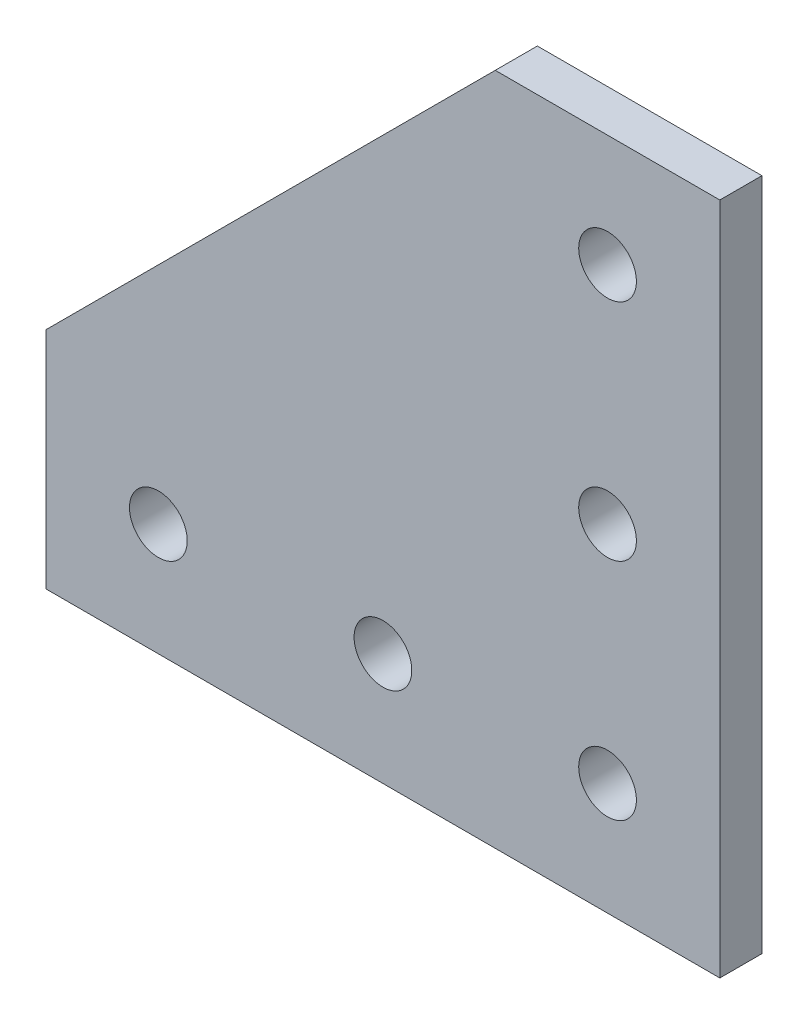
ISO-10303-21;
HEADER;
FILE_DESCRIPTION(('STEP AP214'),'2;1');
FILE_NAME('part.step','',(''),(''),'','','');
FILE_SCHEMA(('AUTOMOTIVE_DESIGN { 1 0 10303 214 1 1 1 1 }'));
ENDSEC;
DATA;
#1=APPLICATION_CONTEXT('core data for automotive mechanical design processes');
#2=APPLICATION_PROTOCOL_DEFINITION('international standard','automotive_design',2000,#1);
#3=PRODUCT_CONTEXT('',#1,'mechanical');
#4=PRODUCT('Part','Part','',(#3));
#5=PRODUCT_RELATED_PRODUCT_CATEGORY('part','',(#4));
#6=PRODUCT_DEFINITION_FORMATION('','',#4);
#7=PRODUCT_DEFINITION_CONTEXT('part definition',#1,'design');
#8=PRODUCT_DEFINITION('design','',#6,#7);
#9=PRODUCT_DEFINITION_SHAPE('','',#8);
#10=(LENGTH_UNIT() NAMED_UNIT(*) SI_UNIT(.MILLI.,.METRE.));
#11=(NAMED_UNIT(*) PLANE_ANGLE_UNIT() SI_UNIT($,.RADIAN.));
#12=(NAMED_UNIT(*) SI_UNIT($,.STERADIAN.) SOLID_ANGLE_UNIT());
#13=UNCERTAINTY_MEASURE_WITH_UNIT(LENGTH_MEASURE(1.E-05),#10,'distance_accuracy_value','');
#14=(GEOMETRIC_REPRESENTATION_CONTEXT(3) GLOBAL_UNCERTAINTY_ASSIGNED_CONTEXT((#13)) GLOBAL_UNIT_ASSIGNED_CONTEXT((#10,
#11,#12)) REPRESENTATION_CONTEXT('',''));
#15=CARTESIAN_POINT('',(0.,0.,0.));
#16=DIRECTION('',(0.,0.,1.));
#17=DIRECTION('',(1.,0.,0.));
#18=AXIS2_PLACEMENT_3D('',#15,#16,#17);
#19=CARTESIAN_POINT('',(-25.4,-25.4,-4.7625));
#20=DIRECTION('',(-0.707106781186548,0.707106781186547,0.));
#21=DIRECTION('',(-0.707106781186547,-0.707106781186548,0.));
#22=AXIS2_PLACEMENT_3D('',#19,#20,#21);
#23=PLANE('',#22);
#24=DIRECTION('',(-0.707106781186547,-0.707106781186548,0.));
#25=VECTOR('',#24,1.);
#26=CARTESIAN_POINT('',(-25.4,-25.4,0.));
#27=LINE('',#26,#25);
#28=CARTESIAN_POINT('',(25.4,25.4,0.));
#29=VERTEX_POINT('',#28);
#30=CARTESIAN_POINT('',(-25.4,-25.4,0.));
#31=VERTEX_POINT('',#30);
#32=EDGE_CURVE('E109',#29,#31,#27,.T.);
#33=ORIENTED_EDGE('',*,*,#32,.F.);
#34=DIRECTION('',(0.,0.,1.));
#35=VECTOR('',#34,1.);
#36=CARTESIAN_POINT('',(25.4,25.4,-4.7625));
#37=LINE('',#36,#35);
#38=CARTESIAN_POINT('',(25.4,25.4,-4.7625));
#39=VERTEX_POINT('',#38);
#40=EDGE_CURVE('E11',#39,#29,#37,.T.);
#41=ORIENTED_EDGE('',*,*,#40,.F.);
#42=DIRECTION('',(-0.707106781186547,-0.707106781186548,0.));
#43=VECTOR('',#42,1.);
#44=CARTESIAN_POINT('',(-25.4,-25.4,-4.7625));
#45=LINE('',#44,#43);
#46=CARTESIAN_POINT('',(-25.4,-25.4,-4.7625));
#47=VERTEX_POINT('',#46);
#48=EDGE_CURVE('E104',#39,#47,#45,.T.);
#49=ORIENTED_EDGE('',*,*,#48,.T.);
#50=DIRECTION('',(0.,0.,1.));
#51=VECTOR('',#50,1.);
#52=CARTESIAN_POINT('',(-25.4,-25.4,-4.7625));
#53=LINE('',#52,#51);
#54=EDGE_CURVE('E35',#47,#31,#53,.T.);
#55=ORIENTED_EDGE('',*,*,#54,.T.);
#56=EDGE_LOOP('',(#33,#41,#49,#55));
#57=FACE_BOUND('',#56,.T.);
#58=ADVANCED_FACE('F32',(#57),#23,.T.);
#59=CARTESIAN_POINT('',(25.4,25.4,-4.7625));
#60=DIRECTION('',(0.,1.,0.));
#61=DIRECTION('',(0.,0.,1.));
#62=AXIS2_PLACEMENT_3D('',#59,#60,#61);
#63=PLANE('',#62);
#64=DIRECTION('',(-1.,0.,0.));
#65=VECTOR('',#64,1.);
#66=CARTESIAN_POINT('',(25.4,25.4,0.));
#67=LINE('',#66,#65);
#68=CARTESIAN_POINT('',(50.8,25.4,0.));
#69=VERTEX_POINT('',#68);
#70=EDGE_CURVE('E119',#69,#29,#67,.T.);
#71=ORIENTED_EDGE('',*,*,#70,.F.);
#72=DIRECTION('',(0.,0.,1.));
#73=VECTOR('',#72,1.);
#74=CARTESIAN_POINT('',(50.8,25.4,-4.7625));
#75=LINE('',#74,#73);
#76=CARTESIAN_POINT('',(50.8,25.4,-4.7625));
#77=VERTEX_POINT('',#76);
#78=EDGE_CURVE('E41',#77,#69,#75,.T.);
#79=ORIENTED_EDGE('',*,*,#78,.F.);
#80=DIRECTION('',(-1.,0.,0.));
#81=VECTOR('',#80,1.);
#82=CARTESIAN_POINT('',(25.4,25.4,-4.7625));
#83=LINE('',#82,#81);
#84=EDGE_CURVE('E99',#77,#39,#83,.T.);
#85=ORIENTED_EDGE('',*,*,#84,.T.);
#86=ORIENTED_EDGE('',*,*,#40,.T.);
#87=EDGE_LOOP('',(#71,#79,#85,#86));
#88=FACE_BOUND('',#87,.T.);
#89=ADVANCED_FACE('F125',(#88),#63,.T.);
#90=CARTESIAN_POINT('',(50.8,25.4,-4.7625));
#91=DIRECTION('',(1.,0.,0.));
#92=DIRECTION('',(0.,1.,0.));
#93=AXIS2_PLACEMENT_3D('',#90,#91,#92);
#94=PLANE('',#93);
#95=DIRECTION('',(0.,1.,0.));
#96=VECTOR('',#95,1.);
#97=CARTESIAN_POINT('',(50.8,25.4,0.));
#98=LINE('',#97,#96);
#99=CARTESIAN_POINT('',(50.8,-50.8,0.));
#100=VERTEX_POINT('',#99);
#101=EDGE_CURVE('E88',#100,#69,#98,.T.);
#102=ORIENTED_EDGE('',*,*,#101,.F.);
#103=DIRECTION('',(0.,0.,1.));
#104=VECTOR('',#103,1.);
#105=CARTESIAN_POINT('',(50.8,-50.8,-4.7625));
#106=LINE('',#105,#104);
#107=CARTESIAN_POINT('',(50.8,-50.8,-4.7625));
#108=VERTEX_POINT('',#107);
#109=EDGE_CURVE('E83',#108,#100,#106,.T.);
#110=ORIENTED_EDGE('',*,*,#109,.F.);
#111=DIRECTION('',(0.,1.,0.));
#112=VECTOR('',#111,1.);
#113=CARTESIAN_POINT('',(50.8,25.4,-4.7625));
#114=LINE('',#113,#112);
#115=EDGE_CURVE('E86',#108,#77,#114,.T.);
#116=ORIENTED_EDGE('',*,*,#115,.T.);
#117=ORIENTED_EDGE('',*,*,#78,.T.);
#118=EDGE_LOOP('',(#102,#110,#116,#117));
#119=FACE_BOUND('',#118,.T.);
#120=ADVANCED_FACE('F85',(#119),#94,.T.);
#121=CARTESIAN_POINT('',(50.8,-50.8,-4.7625));
#122=DIRECTION('',(0.,-1.,0.));
#123=DIRECTION('',(1.,0.,0.));
#124=AXIS2_PLACEMENT_3D('',#121,#122,#123);
#125=PLANE('',#124);
#126=DIRECTION('',(1.,0.,0.));
#127=VECTOR('',#126,1.);
#128=CARTESIAN_POINT('',(50.8,-50.8,0.));
#129=LINE('',#128,#127);
#130=CARTESIAN_POINT('',(-25.4,-50.8,0.));
#131=VERTEX_POINT('',#130);
#132=EDGE_CURVE('E116',#131,#100,#129,.T.);
#133=ORIENTED_EDGE('',*,*,#132,.F.);
#134=DIRECTION('',(0.,0.,1.));
#135=VECTOR('',#134,1.);
#136=CARTESIAN_POINT('',(-25.4,-50.8,-4.7625));
#137=LINE('',#136,#135);
#138=CARTESIAN_POINT('',(-25.4,-50.8,-4.7625));
#139=VERTEX_POINT('',#138);
#140=EDGE_CURVE('E93',#139,#131,#137,.T.);
#141=ORIENTED_EDGE('',*,*,#140,.F.);
#142=DIRECTION('',(1.,0.,0.));
#143=VECTOR('',#142,1.);
#144=CARTESIAN_POINT('',(50.8,-50.8,-4.7625));
#145=LINE('',#144,#143);
#146=EDGE_CURVE('E98',#139,#108,#145,.T.);
#147=ORIENTED_EDGE('',*,*,#146,.T.);
#148=ORIENTED_EDGE('',*,*,#109,.T.);
#149=EDGE_LOOP('',(#133,#141,#147,#148));
#150=FACE_BOUND('',#149,.T.);
#151=ADVANCED_FACE('F101',(#150),#125,.T.);
#152=CARTESIAN_POINT('',(-25.4,-50.8,-4.7625));
#153=DIRECTION('',(-1.,0.,0.));
#154=DIRECTION('',(0.,0.,1.));
#155=AXIS2_PLACEMENT_3D('',#152,#153,#154);
#156=PLANE('',#155);
#157=DIRECTION('',(0.,-1.,0.));
#158=VECTOR('',#157,1.);
#159=CARTESIAN_POINT('',(-25.4,-50.8,0.));
#160=LINE('',#159,#158);
#161=EDGE_CURVE('E112',#31,#131,#160,.T.);
#162=ORIENTED_EDGE('',*,*,#161,.F.);
#163=ORIENTED_EDGE('',*,*,#54,.F.);
#164=DIRECTION('',(0.,-1.,0.));
#165=VECTOR('',#164,1.);
#166=CARTESIAN_POINT('',(-25.4,-50.8,-4.7625));
#167=LINE('',#166,#165);
#168=EDGE_CURVE('E102',#47,#139,#167,.T.);
#169=ORIENTED_EDGE('',*,*,#168,.T.);
#170=ORIENTED_EDGE('',*,*,#140,.T.);
#171=EDGE_LOOP('',(#162,#163,#169,#170));
#172=FACE_BOUND('',#171,.T.);
#173=ADVANCED_FACE('F122',(#172),#156,.T.);
#174=CARTESIAN_POINT('',(25.4,25.4,-4.7625));
#175=DIRECTION('',(0.,0.,-1.));
#176=DIRECTION('',(-1.,0.,0.));
#177=AXIS2_PLACEMENT_3D('',#174,#175,#176);
#178=PLANE('',#177);
#179=CARTESIAN_POINT('',(38.1,12.7,-4.7625));
#180=DIRECTION('',(0.,0.,-1.));
#181=DIRECTION('',(-1.,0.,0.));
#182=AXIS2_PLACEMENT_3D('',#179,#180,#181);
#183=CIRCLE('',#182,3.2639);
#184=CARTESIAN_POINT('',(34.8361,12.7,-4.7625));
#185=VERTEX_POINT('',#184);
#186=EDGE_CURVE('E175',#185,#185,#183,.T.);
#187=ORIENTED_EDGE('',*,*,#186,.F.);
#188=EDGE_LOOP('',(#187));
#189=FACE_BOUND('',#188,.T.);
#190=CARTESIAN_POINT('',(38.1,-12.7,-4.7625));
#191=DIRECTION('',(0.,0.,-1.));
#192=DIRECTION('',(-1.,0.,0.));
#193=AXIS2_PLACEMENT_3D('',#190,#191,#192);
#194=CIRCLE('',#193,3.2639);
#195=CARTESIAN_POINT('',(34.8361,-12.7,-4.7625));
#196=VERTEX_POINT('',#195);
#197=EDGE_CURVE('E177',#196,#196,#194,.T.);
#198=ORIENTED_EDGE('',*,*,#197,.F.);
#199=EDGE_LOOP('',(#198));
#200=FACE_BOUND('',#199,.T.);
#201=CARTESIAN_POINT('',(-12.7,-38.1,-4.7625));
#202=DIRECTION('',(0.,0.,-1.));
#203=DIRECTION('',(-1.,0.,0.));
#204=AXIS2_PLACEMENT_3D('',#201,#202,#203);
#205=CIRCLE('',#204,3.2639);
#206=CARTESIAN_POINT('',(-15.9639,-38.1,-4.7625));
#207=VERTEX_POINT('',#206);
#208=EDGE_CURVE('E183',#207,#207,#205,.T.);
#209=ORIENTED_EDGE('',*,*,#208,.F.);
#210=EDGE_LOOP('',(#209));
#211=FACE_BOUND('',#210,.T.);
#212=CARTESIAN_POINT('',(12.7,-38.1,-4.7625));
#213=DIRECTION('',(0.,0.,-1.));
#214=DIRECTION('',(-1.,0.,0.));
#215=AXIS2_PLACEMENT_3D('',#212,#213,#214);
#216=CIRCLE('',#215,3.2639);
#217=CARTESIAN_POINT('',(9.43609999999995,-38.1,-4.7625));
#218=VERTEX_POINT('',#217);
#219=EDGE_CURVE('E189',#218,#218,#216,.T.);
#220=ORIENTED_EDGE('',*,*,#219,.F.);
#221=EDGE_LOOP('',(#220));
#222=FACE_BOUND('',#221,.T.);
#223=CARTESIAN_POINT('',(38.1,-38.1,-4.7625));
#224=DIRECTION('',(0.,0.,-1.));
#225=DIRECTION('',(-1.,0.,0.));
#226=AXIS2_PLACEMENT_3D('',#223,#224,#225);
#227=CIRCLE('',#226,3.2639);
#228=CARTESIAN_POINT('',(34.8361,-38.1,-4.7625));
#229=VERTEX_POINT('',#228);
#230=EDGE_CURVE('E195',#229,#229,#227,.T.);
#231=ORIENTED_EDGE('',*,*,#230,.F.);
#232=EDGE_LOOP('',(#231));
#233=FACE_BOUND('',#232,.T.);
#234=ORIENTED_EDGE('',*,*,#48,.F.);
#235=ORIENTED_EDGE('',*,*,#84,.F.);
#236=ORIENTED_EDGE('',*,*,#115,.F.);
#237=ORIENTED_EDGE('',*,*,#146,.F.);
#238=ORIENTED_EDGE('',*,*,#168,.F.);
#239=EDGE_LOOP('',(#234,#235,#236,#237,#238));
#240=FACE_BOUND('',#239,.T.);
#241=ADVANCED_FACE('F97',(#189,#200,#211,#222,#233,#240),#178,.T.);
#242=CARTESIAN_POINT('',(25.4,25.4,0.));
#243=DIRECTION('',(0.,0.,-1.));
#244=DIRECTION('',(-1.,0.,0.));
#245=AXIS2_PLACEMENT_3D('',#242,#243,#244);
#246=PLANE('',#245);
#247=CARTESIAN_POINT('',(38.1,12.7,0.));
#248=DIRECTION('',(0.,0.,-1.));
#249=DIRECTION('',(-1.,0.,0.));
#250=AXIS2_PLACEMENT_3D('',#247,#248,#249);
#251=CIRCLE('',#250,3.2639);
#252=CARTESIAN_POINT('',(34.8361,12.7,0.));
#253=VERTEX_POINT('',#252);
#254=EDGE_CURVE('E173',#253,#253,#251,.T.);
#255=ORIENTED_EDGE('',*,*,#254,.T.);
#256=EDGE_LOOP('',(#255));
#257=FACE_BOUND('',#256,.T.);
#258=CARTESIAN_POINT('',(38.1,-12.7,0.));
#259=DIRECTION('',(0.,0.,-1.));
#260=DIRECTION('',(-1.,0.,0.));
#261=AXIS2_PLACEMENT_3D('',#258,#259,#260);
#262=CIRCLE('',#261,3.2639);
#263=CARTESIAN_POINT('',(34.8361,-12.7,0.));
#264=VERTEX_POINT('',#263);
#265=EDGE_CURVE('E180',#264,#264,#262,.T.);
#266=ORIENTED_EDGE('',*,*,#265,.T.);
#267=EDGE_LOOP('',(#266));
#268=FACE_BOUND('',#267,.T.);
#269=CARTESIAN_POINT('',(-12.7,-38.1,0.));
#270=DIRECTION('',(0.,0.,-1.));
#271=DIRECTION('',(-1.,0.,0.));
#272=AXIS2_PLACEMENT_3D('',#269,#270,#271);
#273=CIRCLE('',#272,3.2639);
#274=CARTESIAN_POINT('',(-15.9639,-38.1,0.));
#275=VERTEX_POINT('',#274);
#276=EDGE_CURVE('E186',#275,#275,#273,.T.);
#277=ORIENTED_EDGE('',*,*,#276,.T.);
#278=EDGE_LOOP('',(#277));
#279=FACE_BOUND('',#278,.T.);
#280=CARTESIAN_POINT('',(12.7,-38.1,0.));
#281=DIRECTION('',(0.,0.,-1.));
#282=DIRECTION('',(-1.,0.,0.));
#283=AXIS2_PLACEMENT_3D('',#280,#281,#282);
#284=CIRCLE('',#283,3.2639);
#285=CARTESIAN_POINT('',(9.43609999999995,-38.1,0.));
#286=VERTEX_POINT('',#285);
#287=EDGE_CURVE('E192',#286,#286,#284,.T.);
#288=ORIENTED_EDGE('',*,*,#287,.T.);
#289=EDGE_LOOP('',(#288));
#290=FACE_BOUND('',#289,.T.);
#291=CARTESIAN_POINT('',(38.1,-38.1,0.));
#292=DIRECTION('',(0.,0.,-1.));
#293=DIRECTION('',(-1.,0.,0.));
#294=AXIS2_PLACEMENT_3D('',#291,#292,#293);
#295=CIRCLE('',#294,3.2639);
#296=CARTESIAN_POINT('',(34.8361,-38.1,0.));
#297=VERTEX_POINT('',#296);
#298=EDGE_CURVE('E113',#297,#297,#295,.T.);
#299=ORIENTED_EDGE('',*,*,#298,.T.);
#300=EDGE_LOOP('',(#299));
#301=FACE_BOUND('',#300,.T.);
#302=ORIENTED_EDGE('',*,*,#32,.T.);
#303=ORIENTED_EDGE('',*,*,#161,.T.);
#304=ORIENTED_EDGE('',*,*,#132,.T.);
#305=ORIENTED_EDGE('',*,*,#101,.T.);
#306=ORIENTED_EDGE('',*,*,#70,.T.);
#307=EDGE_LOOP('',(#302,#303,#304,#305,#306));
#308=FACE_BOUND('',#307,.T.);
#309=ADVANCED_FACE('F124',(#257,#268,#279,#290,#301,#308),#246,.F.);
#310=CARTESIAN_POINT('',(38.1,-38.1,0.));
#311=DIRECTION('',(0.,0.,-1.));
#312=DIRECTION('',(-1.,0.,0.));
#313=AXIS2_PLACEMENT_3D('',#310,#311,#312);
#314=CYLINDRICAL_SURFACE('',#313,3.2639);
#315=ORIENTED_EDGE('',*,*,#298,.F.);
#316=EDGE_LOOP('',(#315));
#317=FACE_BOUND('',#316,.T.);
#318=ORIENTED_EDGE('',*,*,#230,.T.);
#319=EDGE_LOOP('',(#318));
#320=FACE_BOUND('',#319,.T.);
#321=ADVANCED_FACE('F145',(#317,#320),#314,.F.);
#322=CARTESIAN_POINT('',(12.7,-38.1,0.));
#323=DIRECTION('',(0.,0.,-1.));
#324=DIRECTION('',(-1.,0.,0.));
#325=AXIS2_PLACEMENT_3D('',#322,#323,#324);
#326=CYLINDRICAL_SURFACE('',#325,3.2639);
#327=ORIENTED_EDGE('',*,*,#287,.F.);
#328=EDGE_LOOP('',(#327));
#329=FACE_BOUND('',#328,.T.);
#330=ORIENTED_EDGE('',*,*,#219,.T.);
#331=EDGE_LOOP('',(#330));
#332=FACE_BOUND('',#331,.T.);
#333=ADVANCED_FACE('F152',(#329,#332),#326,.F.);
#334=CARTESIAN_POINT('',(-12.7,-38.1,0.));
#335=DIRECTION('',(0.,0.,-1.));
#336=DIRECTION('',(-1.,0.,0.));
#337=AXIS2_PLACEMENT_3D('',#334,#335,#336);
#338=CYLINDRICAL_SURFACE('',#337,3.2639);
#339=ORIENTED_EDGE('',*,*,#276,.F.);
#340=EDGE_LOOP('',(#339));
#341=FACE_BOUND('',#340,.T.);
#342=ORIENTED_EDGE('',*,*,#208,.T.);
#343=EDGE_LOOP('',(#342));
#344=FACE_BOUND('',#343,.T.);
#345=ADVANCED_FACE('F156',(#341,#344),#338,.F.);
#346=CARTESIAN_POINT('',(38.1,-12.7,0.));
#347=DIRECTION('',(0.,0.,-1.));
#348=DIRECTION('',(-1.,0.,0.));
#349=AXIS2_PLACEMENT_3D('',#346,#347,#348);
#350=CYLINDRICAL_SURFACE('',#349,3.2639);
#351=ORIENTED_EDGE('',*,*,#265,.F.);
#352=EDGE_LOOP('',(#351));
#353=FACE_BOUND('',#352,.T.);
#354=ORIENTED_EDGE('',*,*,#197,.T.);
#355=EDGE_LOOP('',(#354));
#356=FACE_BOUND('',#355,.T.);
#357=ADVANCED_FACE('F160',(#353,#356),#350,.F.);
#358=CARTESIAN_POINT('',(38.1,12.7,0.));
#359=DIRECTION('',(0.,0.,-1.));
#360=DIRECTION('',(-1.,0.,0.));
#361=AXIS2_PLACEMENT_3D('',#358,#359,#360);
#362=CYLINDRICAL_SURFACE('',#361,3.2639);
#363=ORIENTED_EDGE('',*,*,#254,.F.);
#364=EDGE_LOOP('',(#363));
#365=FACE_BOUND('',#364,.T.);
#366=ORIENTED_EDGE('',*,*,#186,.T.);
#367=EDGE_LOOP('',(#366));
#368=FACE_BOUND('',#367,.T.);
#369=ADVANCED_FACE('F164',(#365,#368),#362,.F.);
#370=CLOSED_SHELL('',(#58,#89,#120,#151,#173,#241,#309,#321,#333,#345,#357,#369));
#371=MANIFOLD_SOLID_BREP('B2',#370);
#372=ADVANCED_BREP_SHAPE_REPRESENTATION('',(#18,#371),#14);
#373=SHAPE_DEFINITION_REPRESENTATION(#9,#372);
ENDSEC;
END-ISO-10303-21;
